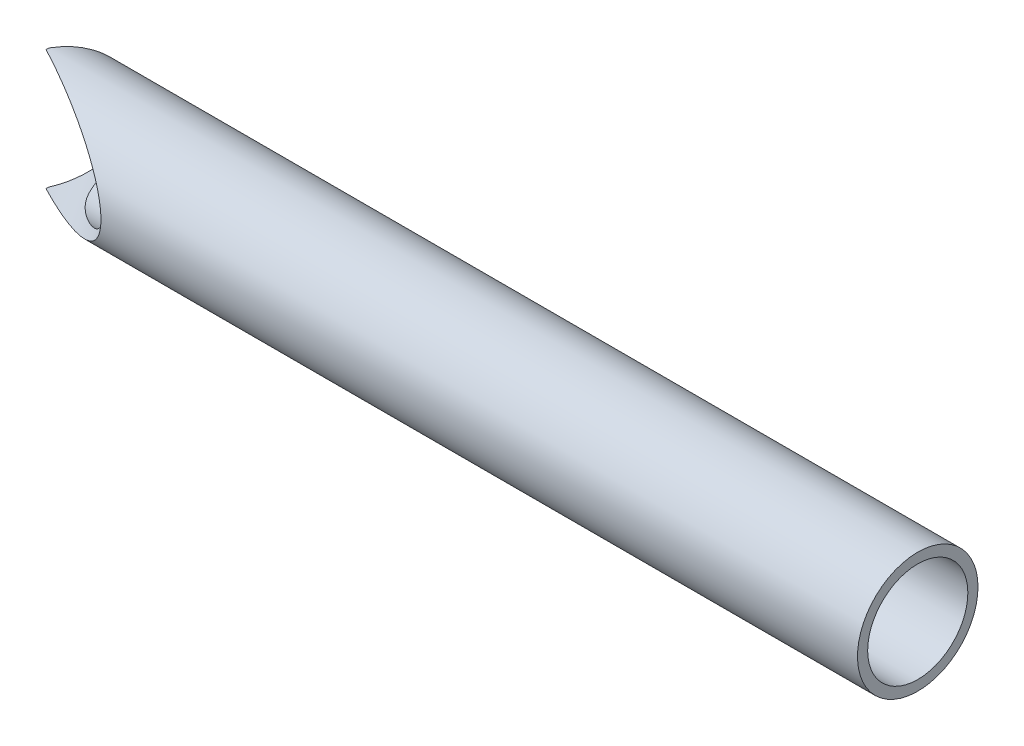
ISO-10303-21;
HEADER;
FILE_DESCRIPTION(('STEP AP214'),'2;1');
FILE_NAME('part.step','',(''),(''),'','','');
FILE_SCHEMA(('AUTOMOTIVE_DESIGN { 1 0 10303 214 1 1 1 1 }'));
ENDSEC;
DATA;
#1=APPLICATION_CONTEXT('core data for automotive mechanical design processes');
#2=APPLICATION_PROTOCOL_DEFINITION('international standard','automotive_design',2000,#1);
#3=PRODUCT_CONTEXT('',#1,'mechanical');
#4=PRODUCT('Part','Part','',(#3));
#5=PRODUCT_RELATED_PRODUCT_CATEGORY('part','',(#4));
#6=PRODUCT_DEFINITION_FORMATION('','',#4);
#7=PRODUCT_DEFINITION_CONTEXT('part definition',#1,'design');
#8=PRODUCT_DEFINITION('design','',#6,#7);
#9=PRODUCT_DEFINITION_SHAPE('','',#8);
#10=(LENGTH_UNIT() NAMED_UNIT(*) SI_UNIT(.MILLI.,.METRE.));
#11=(NAMED_UNIT(*) PLANE_ANGLE_UNIT() SI_UNIT($,.RADIAN.));
#12=(NAMED_UNIT(*) SI_UNIT($,.STERADIAN.) SOLID_ANGLE_UNIT());
#13=UNCERTAINTY_MEASURE_WITH_UNIT(LENGTH_MEASURE(1.E-05),#10,'distance_accuracy_value','');
#14=(GEOMETRIC_REPRESENTATION_CONTEXT(3) GLOBAL_UNCERTAINTY_ASSIGNED_CONTEXT((#13)) GLOBAL_UNIT_ASSIGNED_CONTEXT((#10,
#11,#12)) REPRESENTATION_CONTEXT('',''));
#15=CARTESIAN_POINT('',(0.,0.,0.));
#16=DIRECTION('',(0.,0.,1.));
#17=DIRECTION('',(1.,0.,0.));
#18=AXIS2_PLACEMENT_3D('',#15,#16,#17);
#19=CARTESIAN_POINT('',(304.8,0.,-1.11022302462516E-13));
#20=DIRECTION('',(1.,0.,0.));
#21=DIRECTION('',(0.,0.,-1.));
#22=AXIS2_PLACEMENT_3D('',#19,#20,#21);
#23=PLANE('',#22);
#24=CARTESIAN_POINT('',(304.8,0.,-1.11022302462516E-13));
#25=DIRECTION('',(1.,0.,0.));
#26=DIRECTION('',(0.,0.,-1.));
#27=AXIS2_PLACEMENT_3D('',#24,#25,#26);
#28=CIRCLE('',#27,21.082);
#29=CARTESIAN_POINT('',(304.8,0.,-21.0820000000001));
#30=VERTEX_POINT('',#29);
#31=EDGE_CURVE('E11',#30,#30,#28,.T.);
#32=ORIENTED_EDGE('',*,*,#31,.T.);
#33=EDGE_LOOP('',(#32));
#34=FACE_BOUND('',#33,.T.);
#35=CARTESIAN_POINT('',(304.8,0.,-1.11022302462516E-13));
#36=DIRECTION('',(1.,0.,0.));
#37=DIRECTION('',(0.,0.,-1.));
#38=AXIS2_PLACEMENT_3D('',#35,#36,#37);
#39=CIRCLE('',#38,17.526);
#40=CARTESIAN_POINT('',(304.8,0.,-17.5260000000001));
#41=VERTEX_POINT('',#40);
#42=EDGE_CURVE('E50',#41,#41,#39,.T.);
#43=ORIENTED_EDGE('',*,*,#42,.F.);
#44=EDGE_LOOP('',(#43));
#45=FACE_BOUND('',#44,.T.);
#46=ADVANCED_FACE('F38',(#34,#45),#23,.T.);
#47=CARTESIAN_POINT('',(304.8,0.,-1.11022302462516E-13));
#48=DIRECTION('',(-1.,0.,0.));
#49=DIRECTION('',(0.,0.,1.));
#50=AXIS2_PLACEMENT_3D('',#47,#48,#49);
#51=CYLINDRICAL_SURFACE('',#50,21.082);
#52=ORIENTED_EDGE('',*,*,#31,.F.);
#53=EDGE_LOOP('',(#52));
#54=FACE_BOUND('',#53,.T.);
#55=CARTESIAN_POINT('',(3.88578058618805E-13,0.,-1.11022302462516E-13));
#56=DIRECTION('',(1.,0.,0.));
#57=DIRECTION('',(0.,-0.999948117648207,0.0101863640131056));
#58=AXIS2_PLACEMENT_3D('',#55,#56,#57);
#59=CIRCLE('',#58,21.082);
#60=CARTESIAN_POINT('',(0.,-21.0809062162596,0.214748926124053));
#61=VERTEX_POINT('',#60);
#62=CARTESIAN_POINT('',(0.,-21.0671006615473,-0.792460545541385));
#63=VERTEX_POINT('',#62);
#64=EDGE_CURVE('E61',#61,#63,#59,.T.);
#65=ORIENTED_EDGE('',*,*,#64,.T.);
#66=CARTESIAN_POINT('',(-0.412528848871219,0.,-6.66133814775094E-13));
#67=DIRECTION('',(-0.887010833178221,0.,-0.461748613235035));
#68=DIRECTION('',(-0.461748613235035,0.,0.887010833178221));
#69=AXIS2_PLACEMENT_3D('',#66,#67,#68);
#70=ELLIPSE('',#69,23.7674662038362,21.082);
#71=CARTESIAN_POINT('',(0.,21.0671006615473,-0.792460545541385));
#72=VERTEX_POINT('',#71);
#73=EDGE_CURVE('E83',#63,#72,#70,.F.);
#74=ORIENTED_EDGE('',*,*,#73,.T.);
#75=CARTESIAN_POINT('',(3.88578058618805E-13,0.,-1.11022302462516E-13));
#76=DIRECTION('',(1.,0.,0.));
#77=DIRECTION('',(0.,0.999293267315585,-0.0375894386462891));
#78=AXIS2_PLACEMENT_3D('',#75,#76,#77);
#79=CIRCLE('',#78,21.082);
#80=CARTESIAN_POINT('',(0.,21.0809062162596,0.214748926124053));
#81=VERTEX_POINT('',#80);
#82=EDGE_CURVE('E69',#72,#81,#79,.T.);
#83=ORIENTED_EDGE('',*,*,#82,.T.);
#84=CARTESIAN_POINT('',(-0.412528848871219,0.,-6.66133814775094E-13));
#85=DIRECTION('',(-0.461748613235035,0.,0.887010833178221));
#86=DIRECTION('',(-0.887010833178221,0.,-0.461748613235035));
#87=AXIS2_PLACEMENT_3D('',#84,#85,#86);
#88=ELLIPSE('',#87,45.6568777809605,21.082);
#89=EDGE_CURVE('E77',#81,#61,#88,.F.);
#90=ORIENTED_EDGE('',*,*,#89,.T.);
#91=EDGE_LOOP('',(#65,#74,#83,#90));
#92=FACE_BOUND('',#91,.T.);
#93=ADVANCED_FACE('F40',(#54,#92),#51,.T.);
#94=CARTESIAN_POINT('',(304.8,0.,-1.11022302462516E-13));
#95=DIRECTION('',(-1.,0.,0.));
#96=DIRECTION('',(0.,0.,1.));
#97=AXIS2_PLACEMENT_3D('',#94,#95,#96);
#98=CYLINDRICAL_SURFACE('',#97,17.526);
#99=CARTESIAN_POINT('',(37.5956783460614,0.,17.5259999999997));
#100=CARTESIAN_POINT('',(37.5956757343342,-0.266591693921366,17.5259985254669));
#101=CARTESIAN_POINT('',(37.5852195806184,-0.533210368528521,17.5199024315982));
#102=CARTESIAN_POINT('',(37.5436769043272,-1.06428712664258,17.4956756124853));
#103=CARTESIAN_POINT('',(37.5125879680132,-1.32874495369672,17.4775434791977));
#104=CARTESIAN_POINT('',(37.4305715696158,-1.85371106065216,17.4296861124361));
#105=CARTESIAN_POINT('',(37.3796276924534,-2.11421588678214,17.3999512864077));
#106=CARTESIAN_POINT('',(37.2591517268877,-2.62940395903123,17.3295862109745));
#107=CARTESIAN_POINT('',(37.1896153738036,-2.88408585493862,17.2889534618334));
#108=CARTESIAN_POINT('',(37.0150763552254,-3.44546735012382,17.186879440517));
#109=CARTESIAN_POINT('',(36.9055779186927,-3.75029344773679,17.1227912894422));
#110=CARTESIAN_POINT('',(36.6636867105998,-4.34735917200366,16.981031459871));
#111=CARTESIAN_POINT('',(36.5312881321429,-4.63959558269722,16.9033563360054));
#112=CARTESIAN_POINT('',(36.1040445889777,-5.4968905859841,16.6523151825902));
#113=CARTESIAN_POINT('',(35.7793158505715,-6.0420357616058,16.4610289865015));
#114=CARTESIAN_POINT('',(35.1484677628083,-6.96670284677443,16.0878480383628));
#115=CARTESIAN_POINT('',(34.8532048965475,-7.35672085388379,15.91268416022));
#116=CARTESIAN_POINT('',(34.2350752115212,-8.10560937801357,15.5445733115743));
#117=CARTESIAN_POINT('',(33.9121916783198,-8.46446076631484,15.3516155676615));
#118=CARTESIAN_POINT('',(33.2447171596937,-9.15363558856362,14.9509484423164));
#119=CARTESIAN_POINT('',(32.9000894741168,-9.48390843229503,14.7432140410215));
#120=CARTESIAN_POINT('',(32.1942280749967,-10.1179099352186,14.3155440312093));
#121=CARTESIAN_POINT('',(31.8329883035228,-10.4216287919351,14.0956039655078));
#122=CARTESIAN_POINT('',(31.1256292114688,-10.982526906228,13.6623788783866));
#123=CARTESIAN_POINT('',(30.7804465328531,-11.2414888863027,13.4498579597254));
#124=CARTESIAN_POINT('',(30.0814528778671,-11.7401811112135,13.0168295574418));
#125=CARTESIAN_POINT('',(29.7276432542762,-11.9799143463133,12.796323323388));
#126=CARTESIAN_POINT('',(29.0128897012653,-12.4418004773528,12.3477127317297));
#127=CARTESIAN_POINT('',(28.6519396593035,-12.663937417077,12.1196017385253));
#128=CARTESIAN_POINT('',(27.9247645702659,-13.0916008440151,11.6563304804557));
#129=CARTESIAN_POINT('',(27.5585393416381,-13.2971267579232,11.4211699726703));
#130=CARTESIAN_POINT('',(26.821375562095,-13.6930015234821,10.9434377772123));
#131=CARTESIAN_POINT('',(26.4504284150518,-13.8833159942265,10.7008509244595));
#132=CARTESIAN_POINT('',(25.7058508428144,-14.2490951262902,10.2087198159034));
#133=CARTESIAN_POINT('',(25.3322204254746,-14.4245598310583,9.95917558045949));
#134=CARTESIAN_POINT('',(24.5836334089568,-14.7612126203226,9.45302136990812));
#135=CARTESIAN_POINT('',(24.2086775602099,-14.9224077488864,9.19641496392709));
#136=CARTESIAN_POINT('',(23.4584259946178,-15.2311010777694,8.67559134317339));
#137=CARTESIAN_POINT('',(23.083130287422,-15.3785996553676,8.41137433830159));
#138=CARTESIAN_POINT('',(22.4198497942577,-15.6277404739815,7.93654518426499));
#139=CARTESIAN_POINT('',(22.1316819550169,-15.7321153030365,7.72761706802599));
#140=CARTESIAN_POINT('',(21.5564880179457,-15.9329906700675,7.3044741940868));
#141=CARTESIAN_POINT('',(21.2694618979442,-16.029491361669,7.09025953963391));
#142=CARTESIAN_POINT('',(20.6971292390352,-16.2146350747561,6.65597683210696));
#143=CARTESIAN_POINT('',(20.4118233651604,-16.3032752188436,6.43590667360188));
#144=CARTESIAN_POINT('',(19.8438444104349,-16.4725425248561,5.98940922713016));
#145=CARTESIAN_POINT('',(19.5611711536262,-16.5531702258484,5.76298236815083));
#146=CARTESIAN_POINT('',(19.0001941144989,-16.7059747611284,5.30372351987854));
#147=CARTESIAN_POINT('',(18.7218799280404,-16.7781757475843,5.07091232223927));
#148=CARTESIAN_POINT('',(18.1698685960631,-16.9140531496684,4.59740790092257));
#149=CARTESIAN_POINT('',(17.8961716931655,-16.9777291185504,4.35671426499469));
#150=CARTESIAN_POINT('',(17.3549460163737,-17.0959968006572,3.86666131930177));
#151=CARTESIAN_POINT('',(17.0874132651965,-17.1505945213461,3.61730787325212));
#152=CARTESIAN_POINT('',(16.5600485107867,-17.2500269948893,3.10875660024493));
#153=CARTESIAN_POINT('',(16.3002151819178,-17.2948634369138,2.84956048567374));
#154=CARTESIAN_POINT('',(15.7866388580657,-17.3743736027317,2.31635879089339));
#155=CARTESIAN_POINT('',(15.5330356712516,-17.4088931841124,2.04219466678285));
#156=CARTESIAN_POINT('',(15.0385209099801,-17.4655588493314,1.4813404005012));
#157=CARTESIAN_POINT('',(14.7976093452937,-17.4877049236437,1.19465024868688));
#158=CARTESIAN_POINT('',(14.3320609894755,-17.5179015985779,0.608185347775268));
#159=CARTESIAN_POINT('',(14.107402267984,-17.5259715458154,0.308429139148951));
#160=CARTESIAN_POINT('',(13.6778075547061,-17.5260282825475,-0.304956753795662));
#161=CARTESIAN_POINT('',(13.4728676227163,-17.5180182921543,-0.61858364811869));
#162=CARTESIAN_POINT('',(13.1171103065544,-17.4863488686435,-1.20885680149257));
#163=CARTESIAN_POINT('',(12.9628494709119,-17.465347769395,-1.48356510155695));
#164=CARTESIAN_POINT('',(12.6735025828289,-17.4089497727558,-2.04149872177959));
#165=CARTESIAN_POINT('',(12.5384143994389,-17.3735544769048,-2.32472309116995));
#166=CARTESIAN_POINT('',(12.289374688493,-17.2872171159725,-2.89769174726171));
#167=CARTESIAN_POINT('',(12.175401352853,-17.2362912368986,-3.18742895643231));
#168=CARTESIAN_POINT('',(11.9694540243186,-17.1180108253338,-3.77135210278651));
#169=CARTESIAN_POINT('',(11.8774802782599,-17.0506561085281,-4.06553808984612));
#170=CARTESIAN_POINT('',(11.7155617426973,-16.8990863040413,-4.65556815442476));
#171=CARTESIAN_POINT('',(11.6456142051966,-16.8148733217489,-4.95141202041519));
#172=CARTESIAN_POINT('',(11.5267241499273,-16.6295723661745,-5.54200289702484));
#173=CARTESIAN_POINT('',(11.4777819747979,-16.5284841176609,-5.83674988967414));
#174=CARTESIAN_POINT('',(11.3990138978571,-16.3095816124055,-6.42310913947894));
#175=CARTESIAN_POINT('',(11.3692209470817,-16.1917389486219,-6.71471514877025));
#176=CARTESIAN_POINT('',(11.3265474260182,-15.9400030227592,-7.2922067801259));
#177=CARTESIAN_POINT('',(11.3136714016832,-15.8061054569163,-7.57809084426088));
#178=CARTESIAN_POINT('',(11.3002739925266,-15.4720489518085,-8.24381057772075));
#179=CARTESIAN_POINT('',(11.3058518113479,-15.2653651409013,-8.62050709693376));
#180=CARTESIAN_POINT('',(11.3374036085675,-14.8253087575275,-9.35709142082312));
#181=CARTESIAN_POINT('',(11.363384815199,-14.591926751827,-9.7169732207303));
#182=CARTESIAN_POINT('',(11.4302444398313,-14.0999191105803,-10.4180878718908));
#183=CARTESIAN_POINT('',(11.4711383313585,-13.8412674598608,-10.7593009278447));
#184=CARTESIAN_POINT('',(11.5630973693106,-13.30049965019,-11.4210323009506));
#185=CARTESIAN_POINT('',(11.6141616166598,-13.0183855666383,-11.7415524440748));
#186=CARTESIAN_POINT('',(11.723877305285,-12.4248415416481,-12.3683005242646));
#187=CARTESIAN_POINT('',(11.7826856550682,-12.1128576157135,-12.6739759695464));
#188=CARTESIAN_POINT('',(11.9033499851492,-11.4672898100729,-13.260930071901));
#189=CARTESIAN_POINT('',(11.9652059913159,-11.1337057470154,-13.5422085218338));
#190=CARTESIAN_POINT('',(12.089037382753,-10.4466238966316,-14.0790165868124));
#191=CARTESIAN_POINT('',(12.1510127216911,-10.0931327424196,-14.3345547004104));
#192=CARTESIAN_POINT('',(12.2726813712795,-9.36779500958398,-14.8187469142335));
#193=CARTESIAN_POINT('',(12.3323745249596,-8.99594717239198,-15.0473991674692));
#194=CARTESIAN_POINT('',(12.4554216496206,-8.18296116687626,-15.5063479163149));
#195=CARTESIAN_POINT('',(12.5181358309654,-7.7393637885716,-15.7324776236799));
#196=CARTESIAN_POINT('',(12.635481538374,-6.83360646084131,-16.1465318043693));
#197=CARTESIAN_POINT('',(12.6901123379519,-6.3714448477141,-16.3344528442956));
#198=CARTESIAN_POINT('',(12.7893120080732,-5.43172609184849,-16.670514354985));
#199=CARTESIAN_POINT('',(12.8338792630252,-4.95416649117594,-16.8186484391125));
#200=CARTESIAN_POINT('',(12.9114042341611,-3.98726114515002,-17.0737338292837));
#201=CARTESIAN_POINT('',(12.9443625827491,-3.49791604337294,-17.1806873786984));
#202=CARTESIAN_POINT('',(12.9967317603521,-2.52692426099745,-17.3496508360554));
#203=CARTESIAN_POINT('',(13.0165408009014,-2.04552910981843,-17.412984224909));
#204=CARTESIAN_POINT('',(13.0436537689205,-1.0787921600856,-17.4994966465916));
#205=CARTESIAN_POINT('',(13.0509578831511,-0.593450420582789,-17.5226762791164));
#206=CARTESIAN_POINT('',(13.0528400761785,0.377417221037651,-17.5286579845347));
#207=CARTESIAN_POINT('',(13.0474204439988,0.862943074321155,-17.5114673201131));
#208=CARTESIAN_POINT('',(13.0240232879626,1.83058574634327,-17.4368889572927));
#209=CARTESIAN_POINT('',(13.0060459512341,2.31270261577257,-17.3795018578792));
#210=CARTESIAN_POINT('',(12.9587974572564,3.25565691933255,-17.2273801641892));
#211=CARTESIAN_POINT('',(12.9298786834465,3.71670042411045,-17.1338090355951));
#212=CARTESIAN_POINT('',(12.8615824654994,4.62903445038871,-16.9101539153409));
#213=CARTESIAN_POINT('',(12.8222052772019,5.08032521017438,-16.7800708168533));
#214=CARTESIAN_POINT('',(12.7341823149961,5.97012105047333,-16.484480006277));
#215=CARTESIAN_POINT('',(12.6855381575885,6.40862834553443,-16.3189784718481));
#216=CARTESIAN_POINT('',(12.5805065901408,7.27020881934784,-15.9537982574262));
#217=CARTESIAN_POINT('',(12.5241189866222,7.69328161211793,-15.754118723428));
#218=CARTESIAN_POINT('',(12.4040980127461,8.53126141210142,-15.3168810898396));
#219=CARTESIAN_POINT('',(12.3403250107231,8.94573984374935,-15.0785400386636));
#220=CARTESIAN_POINT('',(12.209137465655,9.75344849428375,-14.5691084262682));
#221=CARTESIAN_POINT('',(12.1417228332117,10.1466781910625,-14.2980170608621));
#222=CARTESIAN_POINT('',(12.0061531026761,10.9102955982285,-13.7242340889998));
#223=CARTESIAN_POINT('',(11.9379969426669,11.2806434375339,-13.4214896683306));
#224=CARTESIAN_POINT('',(11.8047484196985,11.9956707208194,-12.7864462138049));
#225=CARTESIAN_POINT('',(11.7396560708181,12.340350046851,-12.4541470441576));
#226=CARTESIAN_POINT('',(11.6143922419065,13.0163651030946,-11.7466820830764));
#227=CARTESIAN_POINT('',(11.5545562400255,13.3464753324508,-11.3702827066671));
#228=CARTESIAN_POINT('',(11.449477726415,13.9742832041842,-10.589199458683));
#229=CARTESIAN_POINT('',(11.404238970734,14.2719724912267,-10.1845083398392));
#230=CARTESIAN_POINT('',(11.3363402982302,14.8314770762995,-9.35089361299598));
#231=CARTESIAN_POINT('',(11.3136135711169,15.0933965237695,-8.92204572455856));
#232=CARTESIAN_POINT('',(11.2998781075408,15.5795110126255,-8.04307874017645));
#233=CARTESIAN_POINT('',(11.3088436421262,15.8037365004987,-7.59297719153325));
#234=CARTESIAN_POINT('',(11.3575118380126,16.1361570592038,-6.84724835979179));
#235=CARTESIAN_POINT('',(11.3845941460805,16.2565598366814,-6.55618132229623));
#236=CARTESIAN_POINT('',(11.4577022989314,16.4808144307685,-5.97007231241614));
#237=CARTESIAN_POINT('',(11.5037240446164,16.584669822017,-5.67503121350218));
#238=CARTESIAN_POINT('',(11.6165416869377,16.7752836136702,-5.08397482880348));
#239=CARTESIAN_POINT('',(11.683300311057,16.8620722364624,-4.7879622262736));
#240=CARTESIAN_POINT('',(11.8387675203287,17.0187408063841,-4.19720396925863));
#241=CARTESIAN_POINT('',(11.9274764608599,17.0886204797189,-3.90245833536454));
#242=CARTESIAN_POINT('',(12.1270562745918,17.2118865987532,-3.31681574445057));
#243=CARTESIAN_POINT('',(12.2379428344996,17.2652613017055,-3.02592166788568));
#244=CARTESIAN_POINT('',(12.4809373622406,17.356263217038,-2.45064148916974));
#245=CARTESIAN_POINT('',(12.6130454533583,17.3938903379297,-2.16625542483728));
#246=CARTESIAN_POINT('',(12.8969238321857,17.4545951474949,-1.60545023699927));
#247=CARTESIAN_POINT('',(13.0487193832945,17.4776539145677,-1.32904191769746));
#248=CARTESIAN_POINT('',(13.3695753815121,17.51049773706,-0.78565617239405));
#249=CARTESIAN_POINT('',(13.5386381338951,17.5202810176256,-0.518680012062367));
#250=CARTESIAN_POINT('',(13.9929463125557,17.5301658092918,0.155881845784542));
#251=CARTESIAN_POINT('',(14.2891781242162,17.5214865346058,0.556214434911194));
#252=CARTESIAN_POINT('',(14.9094987408837,17.4795481063974,1.33330357089925));
#253=CARTESIAN_POINT('',(15.233606785757,17.4462718540506,1.71004351939387));
#254=CARTESIAN_POINT('',(15.903599957077,17.3587413655962,2.44372112066117));
#255=CARTESIAN_POINT('',(16.2495691656003,17.3044014145171,2.80057095840053));
#256=CARTESIAN_POINT('',(16.9563451504198,17.177499519199,3.4955557887758));
#257=CARTESIAN_POINT('',(17.3171493308719,17.1049407516622,3.83369403150589));
#258=CARTESIAN_POINT('',(18.074145922457,16.9379861627252,4.51629738235474));
#259=CARTESIAN_POINT('',(18.471083609647,16.8424473746218,4.85965034283082));
#260=CARTESIAN_POINT('',(19.2733884584434,16.6340643923991,5.53101200162108));
#261=CARTESIAN_POINT('',(19.6787575192409,16.5212162619974,5.85901718753105));
#262=CARTESIAN_POINT('',(20.4953711895783,16.2788518025198,6.50214129508176));
#263=CARTESIAN_POINT('',(20.9066213653711,16.1493186057658,6.81724674506366));
#264=CARTESIAN_POINT('',(21.7322759971374,15.8739601481862,7.43590455048023));
#265=CARTESIAN_POINT('',(22.1466802307201,15.7281360262871,7.73945771156844));
#266=CARTESIAN_POINT('',(22.9765558974475,15.4201779475868,8.33615240530492));
#267=CARTESIAN_POINT('',(23.3920266585968,15.2580525661829,8.62929930355604));
#268=CARTESIAN_POINT('',(24.2225720431433,14.9170369530587,9.20624600649722));
#269=CARTESIAN_POINT('',(24.6376466707264,14.7381469005152,9.49004591104191));
#270=CARTESIAN_POINT('',(25.4654583709686,14.3631035909842,10.0486317289701));
#271=CARTESIAN_POINT('',(25.8781971935922,14.1669658214909,10.3234254310751));
#272=CARTESIAN_POINT('',(26.7001561774995,13.7563529562482,10.864565800658));
#273=CARTESIAN_POINT('',(27.1093759848904,13.5418760394025,11.1309116256443));
#274=CARTESIAN_POINT('',(27.9786333983786,13.0624984133785,11.6912758648435));
#275=CARTESIAN_POINT('',(28.4378983488399,12.7947226386884,11.9840464662665));
#276=CARTESIAN_POINT('',(29.3466531513817,12.2318070410288,12.5580707245201));
#277=CARTESIAN_POINT('',(29.7961450903892,11.9366731323874,12.8393268517037));
#278=CARTESIAN_POINT('',(30.6815313196358,11.316588041932,13.3890651852282));
#279=CARTESIAN_POINT('',(31.1174374886919,10.991663946639,13.6575586650973));
#280=CARTESIAN_POINT('',(31.9714922286977,10.308622724273,14.1801943290088));
#281=CARTESIAN_POINT('',(32.3896459339594,9.95051529106554,14.4343406695945));
#282=CARTESIAN_POINT('',(33.0909724684634,9.30047282100156,14.8582760382518));
#283=CARTESIAN_POINT('',(33.3797668693346,9.01725019599009,15.0321162426082));
#284=CARTESIAN_POINT('',(33.9418468264398,8.42974785505879,15.369281143416));
#285=CARTESIAN_POINT('',(34.2151309368553,8.1254661819321,15.5326048597452));
#286=CARTESIAN_POINT('',(34.7420393485891,7.49474932244908,15.8465533830212));
#287=CARTESIAN_POINT('',(34.9956883870385,7.16834301570791,15.9971941901468));
#288=CARTESIAN_POINT('',(35.4787823312822,6.49211050864951,16.2833682797996));
#289=CARTESIAN_POINT('',(35.708238799297,6.14229562773736,16.4189087809032));
#290=CARTESIAN_POINT('',(36.2118785474258,5.29239287732205,16.7157850676371));
#291=CARTESIAN_POINT('',(36.4740047590975,4.78223969541902,16.8697821348234));
#292=CARTESIAN_POINT('',(36.8132645979151,3.98678280058907,17.0687141414746));
#293=CARTESIAN_POINT('',(36.9173256065307,3.71673072144591,17.1296591145103));
#294=CARTESIAN_POINT('',(37.1053606543379,3.16731859501964,17.2396959722182));
#295=CARTESIAN_POINT('',(37.1893398051233,2.88796093702899,17.2887908732128));
#296=CARTESIAN_POINT('',(37.3164844256438,2.39370757037564,17.3630772272715));
#297=CARTESIAN_POINT('',(37.3645974720794,2.18050655970892,17.3911721319426));
#298=CARTESIAN_POINT('',(37.4476947578886,1.75070959465793,17.4396797605552));
#299=CARTESIAN_POINT('',(37.4826811647896,1.53411420692665,17.4600937528035));
#300=CARTESIAN_POINT('',(37.5389211973868,1.09851929790022,17.4929024683177));
#301=CARTESIAN_POINT('',(37.5601737212688,0.879519585148737,17.5052965481784));
#302=CARTESIAN_POINT('',(37.5885517079343,0.440352524797704,17.5218449511073));
#303=CARTESIAN_POINT('',(37.5956805031592,0.220185464924857,17.5260012178572));
#304=CARTESIAN_POINT('',(37.5956783460614,0.,17.5259999999997));
#305=B_SPLINE_CURVE_WITH_KNOTS('',3,(#99,#100,#101,#102,#103,#104,#105,#106,#107,#108,#109,#110,
#111,#112,#113,#114,#115,#116,#117,#118,#119,#120,#121,#122,#123,#124,#125,#126,#127,#128,#129,
#130,#131,#132,#133,#134,#135,#136,#137,#138,#139,#140,#141,#142,#143,#144,#145,#146,#147,#148,
#149,#150,#151,#152,#153,#154,#155,#156,#157,#158,#159,#160,#161,#162,#163,#164,#165,#166,#167,
#168,#169,#170,#171,#172,#173,#174,#175,#176,#177,#178,#179,#180,#181,#182,#183,#184,#185,#186,
#187,#188,#189,#190,#191,#192,#193,#194,#195,#196,#197,#198,#199,#200,#201,#202,#203,#204,#205,
#206,#207,#208,#209,#210,#211,#212,#213,#214,#215,#216,#217,#218,#219,#220,#221,#222,#223,#224,
#225,#226,#227,#228,#229,#230,#231,#232,#233,#234,#235,#236,#237,#238,#239,#240,#241,#242,#243,
#244,#245,#246,#247,#248,#249,#250,#251,#252,#253,#254,#255,#256,#257,#258,#259,#260,#261,#262,
#263,#264,#265,#266,#267,#268,#269,#270,#271,#272,#273,#274,#275,#276,#277,#278,#279,#280,#281,
#282,#283,#284,#285,#286,#287,#288,#289,#290,#291,#292,#293,#294,#295,#296,#297,#298,#299,#300,
#301,#302,#303,#304),.UNSPECIFIED.,.T.,.F.,(4,2,2,2,2,2,2,2,2,2,2,2,2,2,2,2,2,2,2,2,2,2,2,2,2,2,
2,2,2,2,2,2,2,2,2,2,2,2,2,2,2,2,2,2,2,2,2,2,2,2,2,2,2,2,2,2,2,2,2,2,2,2,2,2,2,2,2,2,2,2,2,2,2,2,
2,2,2,2,2,2,2,2,2,2,2,2,2,2,2,2,2,2,2,2,2,2,2,2,2,2,2,2,4),(0.,0.79955087643319,
1.59919530530718,2.39950224768414,3.19999291954056,4.18898676247546,5.17823175788323,
7.15830390467635,8.71517370786121,10.2729923954271,11.8335146305073,13.3946105254252,
14.8370915704042,16.27934785837,17.7228973505047,19.1664966434211,20.6132715517281,
22.0600422267772,23.5060946848395,24.9521072987862,26.0647708277064,27.1774126432257,
28.290460080713,29.4034325829683,30.5131324530138,31.6228904531903,32.731911131023,
33.840739742174,34.9653903926484,36.0900419089549,37.2131464517328,38.3360261079532,
39.2823705484477,40.2286097247306,41.1738660793116,42.1191330391891,43.0642820204915,
44.0094464184648,44.9562328848505,45.9032737217397,47.1904956918303,48.4781738871519,
49.7671920076116,51.0560962273561,52.3770042109122,53.6979234083944,55.0184050454852,
56.3389773433335,57.8426297153766,59.34641714468,60.8504458191391,62.3543925478023,
63.8104179830223,65.2664216723379,66.7221634441883,68.1778835238315,69.5902392746402,
71.002560478767,72.4146355472543,73.8267459043939,75.2721935283352,76.7176766525803,
78.165611315058,79.61355263049,81.1242396507248,82.6353150796384,84.1418924422506,
85.6472469905686,86.5948053957449,87.54215882685,88.4878192403258,89.4334949651832,
90.379841967589,91.3261944679008,92.2737735920757,93.2214793894835,94.7131725728188,
96.2059036973172,97.7047740969608,99.2033833291222,100.803094118047,102.403169234783,
104.004874824258,105.606468505748,107.207224021926,108.807962431562,110.407277864421,
112.006752295815,113.826756567519,115.64636830112,117.464341669672,119.281785617041,
120.601832055383,121.922001342696,123.240479398147,124.558324436794,126.33287021968,
127.219285061168,128.10547403575,128.766057266423,129.426531370685,130.087058455553,
130.747429672934),.UNSPECIFIED.);
#306=CARTESIAN_POINT('',(37.5956783460614,0.,17.5259999999997));
#307=VERTEX_POINT('',#306);
#308=EDGE_CURVE('E81',#307,#307,#305,.T.);
#309=ORIENTED_EDGE('',*,*,#308,.F.);
#310=EDGE_LOOP('',(#309));
#311=FACE_BOUND('',#310,.T.);
#312=ORIENTED_EDGE('',*,*,#42,.T.);
#313=EDGE_LOOP('',(#312));
#314=FACE_BOUND('',#313,.T.);
#315=ADVANCED_FACE('F103',(#311,#314),#98,.F.);
#316=CARTESIAN_POINT('',(157.836598427826,0.,226.003175688896));
#317=DIRECTION('',(-0.573576436351044,0.,-0.819152044288993));
#318=DIRECTION('',(-0.819152044288993,0.,0.573576436351044));
#319=AXIS2_PLACEMENT_3D('',#316,#317,#318);
#320=CYLINDRICAL_SURFACE('',#319,21.082);
#321=ORIENTED_EDGE('',*,*,#308,.T.);
#322=EDGE_LOOP('',(#321));
#323=FACE_BOUND('',#322,.T.);
#324=ORIENTED_EDGE('',*,*,#64,.F.);
#325=ORIENTED_EDGE('',*,*,#89,.F.);
#326=ORIENTED_EDGE('',*,*,#82,.F.);
#327=ORIENTED_EDGE('',*,*,#73,.F.);
#328=EDGE_LOOP('',(#324,#325,#326,#327));
#329=FACE_BOUND('',#328,.T.);
#330=ADVANCED_FACE('F78',(#323,#329),#320,.F.);
#331=CLOSED_SHELL('',(#46,#93,#315,#330));
#332=MANIFOLD_SOLID_BREP('B2',#331);
#333=ADVANCED_BREP_SHAPE_REPRESENTATION('',(#18,#332),#14);
#334=SHAPE_DEFINITION_REPRESENTATION(#9,#333);
ENDSEC;
END-ISO-10303-21;
